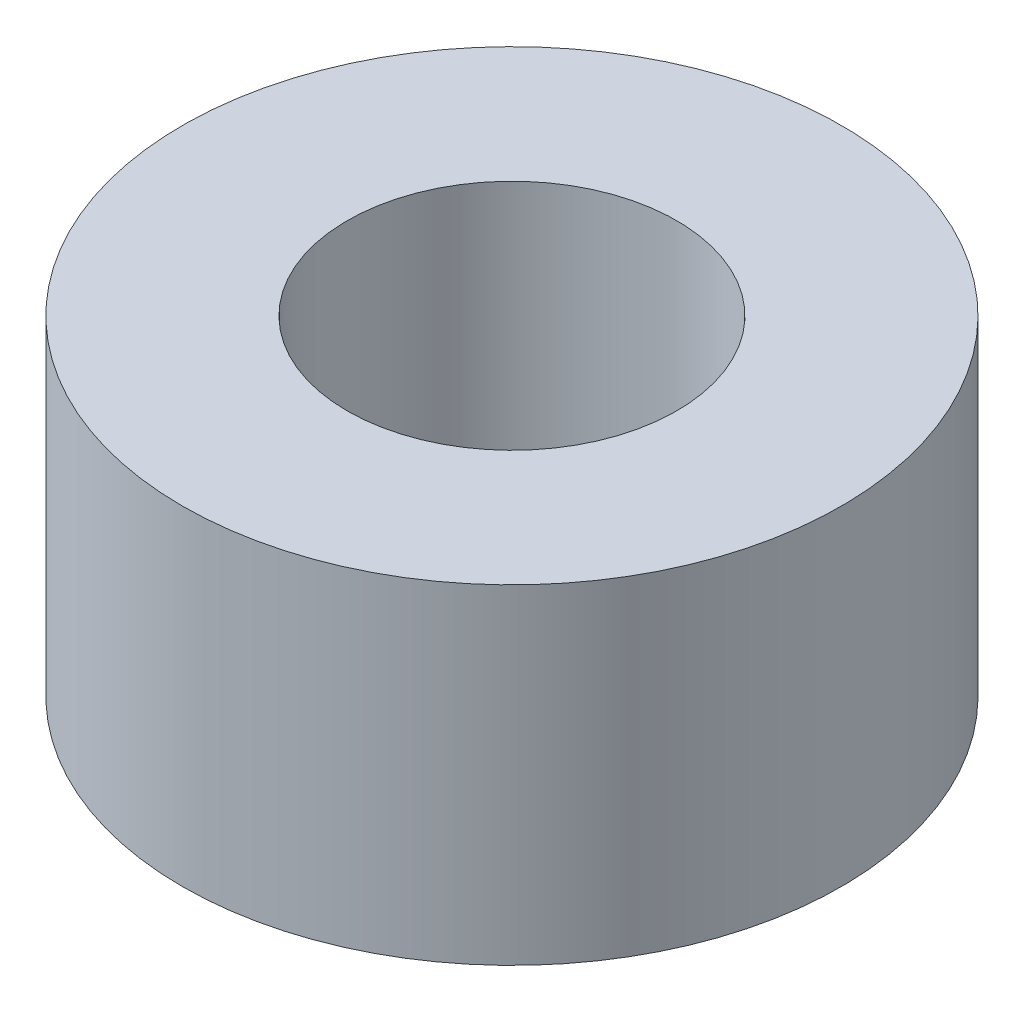
ISO-10303-21;
HEADER;
FILE_DESCRIPTION(('STEP AP214'),'2;1');
FILE_NAME('part.step','',(''),(''),'','','');
FILE_SCHEMA(('AUTOMOTIVE_DESIGN { 1 0 10303 214 1 1 1 1 }'));
ENDSEC;
DATA;
#1=APPLICATION_CONTEXT('core data for automotive mechanical design processes');
#2=APPLICATION_PROTOCOL_DEFINITION('international standard','automotive_design',2000,#1);
#3=PRODUCT_CONTEXT('',#1,'mechanical');
#4=PRODUCT('Part','Part','',(#3));
#5=PRODUCT_RELATED_PRODUCT_CATEGORY('part','',(#4));
#6=PRODUCT_DEFINITION_FORMATION('','',#4);
#7=PRODUCT_DEFINITION_CONTEXT('part definition',#1,'design');
#8=PRODUCT_DEFINITION('design','',#6,#7);
#9=PRODUCT_DEFINITION_SHAPE('','',#8);
#10=(LENGTH_UNIT() NAMED_UNIT(*) SI_UNIT(.MILLI.,.METRE.));
#11=(NAMED_UNIT(*) PLANE_ANGLE_UNIT() SI_UNIT($,.RADIAN.));
#12=(NAMED_UNIT(*) SI_UNIT($,.STERADIAN.) SOLID_ANGLE_UNIT());
#13=UNCERTAINTY_MEASURE_WITH_UNIT(LENGTH_MEASURE(1.E-05),#10,'distance_accuracy_value','');
#14=(GEOMETRIC_REPRESENTATION_CONTEXT(3) GLOBAL_UNCERTAINTY_ASSIGNED_CONTEXT((#13)) GLOBAL_UNIT_ASSIGNED_CONTEXT((#10,
#11,#12)) REPRESENTATION_CONTEXT('',''));
#15=CARTESIAN_POINT('',(0.,0.,0.));
#16=DIRECTION('',(0.,0.,1.));
#17=DIRECTION('',(1.,0.,0.));
#18=AXIS2_PLACEMENT_3D('',#15,#16,#17);
#19=CARTESIAN_POINT('',(0.,3.,0.));
#20=DIRECTION('',(0.,1.,0.));
#21=DIRECTION('',(0.,0.,1.));
#22=AXIS2_PLACEMENT_3D('',#19,#20,#21);
#23=PLANE('',#22);
#24=CARTESIAN_POINT('',(0.,3.,0.));
#25=DIRECTION('',(0.,1.,0.));
#26=DIRECTION('',(0.,0.,1.));
#27=AXIS2_PLACEMENT_3D('',#24,#25,#26);
#28=CIRCLE('',#27,3.);
#29=CARTESIAN_POINT('',(0.,3.,3.));
#30=VERTEX_POINT('',#29);
#31=EDGE_CURVE('E10',#30,#30,#28,.T.);
#32=ORIENTED_EDGE('',*,*,#31,.T.);
#33=EDGE_LOOP('',(#32));
#34=FACE_BOUND('',#33,.T.);
#35=CARTESIAN_POINT('',(0.,3.,0.));
#36=DIRECTION('',(0.,1.,0.));
#37=DIRECTION('',(0.,0.,1.));
#38=AXIS2_PLACEMENT_3D('',#35,#36,#37);
#39=CIRCLE('',#38,1.5);
#40=CARTESIAN_POINT('',(0.,3.,1.5));
#41=VERTEX_POINT('',#40);
#42=EDGE_CURVE('E39',#41,#41,#39,.T.);
#43=ORIENTED_EDGE('',*,*,#42,.F.);
#44=EDGE_LOOP('',(#43));
#45=FACE_BOUND('',#44,.T.);
#46=ADVANCED_FACE('F28',(#34,#45),#23,.T.);
#47=CARTESIAN_POINT('',(0.,0.,0.));
#48=DIRECTION('',(0.,1.,0.));
#49=DIRECTION('',(0.,0.,1.));
#50=AXIS2_PLACEMENT_3D('',#47,#48,#49);
#51=PLANE('',#50);
#52=CARTESIAN_POINT('',(0.,0.,0.));
#53=DIRECTION('',(0.,1.,0.));
#54=DIRECTION('',(0.,0.,1.));
#55=AXIS2_PLACEMENT_3D('',#52,#53,#54);
#56=CIRCLE('',#55,3.);
#57=CARTESIAN_POINT('',(0.,0.,3.));
#58=VERTEX_POINT('',#57);
#59=EDGE_CURVE('E32',#58,#58,#56,.T.);
#60=ORIENTED_EDGE('',*,*,#59,.F.);
#61=EDGE_LOOP('',(#60));
#62=FACE_BOUND('',#61,.T.);
#63=CARTESIAN_POINT('',(0.,0.,0.));
#64=DIRECTION('',(0.,1.,0.));
#65=DIRECTION('',(0.,0.,1.));
#66=AXIS2_PLACEMENT_3D('',#63,#64,#65);
#67=CIRCLE('',#66,1.5);
#68=CARTESIAN_POINT('',(0.,0.,1.5));
#69=VERTEX_POINT('',#68);
#70=EDGE_CURVE('E41',#69,#69,#67,.T.);
#71=ORIENTED_EDGE('',*,*,#70,.T.);
#72=EDGE_LOOP('',(#71));
#73=FACE_BOUND('',#72,.T.);
#74=ADVANCED_FACE('F51',(#62,#73),#51,.F.);
#75=CARTESIAN_POINT('',(0.,3.,0.));
#76=DIRECTION('',(0.,-1.,0.));
#77=DIRECTION('',(0.,0.,-1.));
#78=AXIS2_PLACEMENT_3D('',#75,#76,#77);
#79=CYLINDRICAL_SURFACE('',#78,3.);
#80=ORIENTED_EDGE('',*,*,#31,.F.);
#81=EDGE_LOOP('',(#80));
#82=FACE_BOUND('',#81,.T.);
#83=ORIENTED_EDGE('',*,*,#59,.T.);
#84=EDGE_LOOP('',(#83));
#85=FACE_BOUND('',#84,.T.);
#86=ADVANCED_FACE('F30',(#82,#85),#79,.T.);
#87=CARTESIAN_POINT('',(0.,3.,0.));
#88=DIRECTION('',(0.,-1.,0.));
#89=DIRECTION('',(0.,0.,-1.));
#90=AXIS2_PLACEMENT_3D('',#87,#88,#89);
#91=CYLINDRICAL_SURFACE('',#90,1.5);
#92=ORIENTED_EDGE('',*,*,#42,.T.);
#93=EDGE_LOOP('',(#92));
#94=FACE_BOUND('',#93,.T.);
#95=ORIENTED_EDGE('',*,*,#70,.F.);
#96=EDGE_LOOP('',(#95));
#97=FACE_BOUND('',#96,.T.);
#98=ADVANCED_FACE('F47',(#94,#97),#91,.F.);
#99=CLOSED_SHELL('',(#46,#74,#86,#98));
#100=MANIFOLD_SOLID_BREP('B2',#99);
#101=ADVANCED_BREP_SHAPE_REPRESENTATION('',(#18,#100),#14);
#102=SHAPE_DEFINITION_REPRESENTATION(#9,#101);
ENDSEC;
END-ISO-10303-21;
